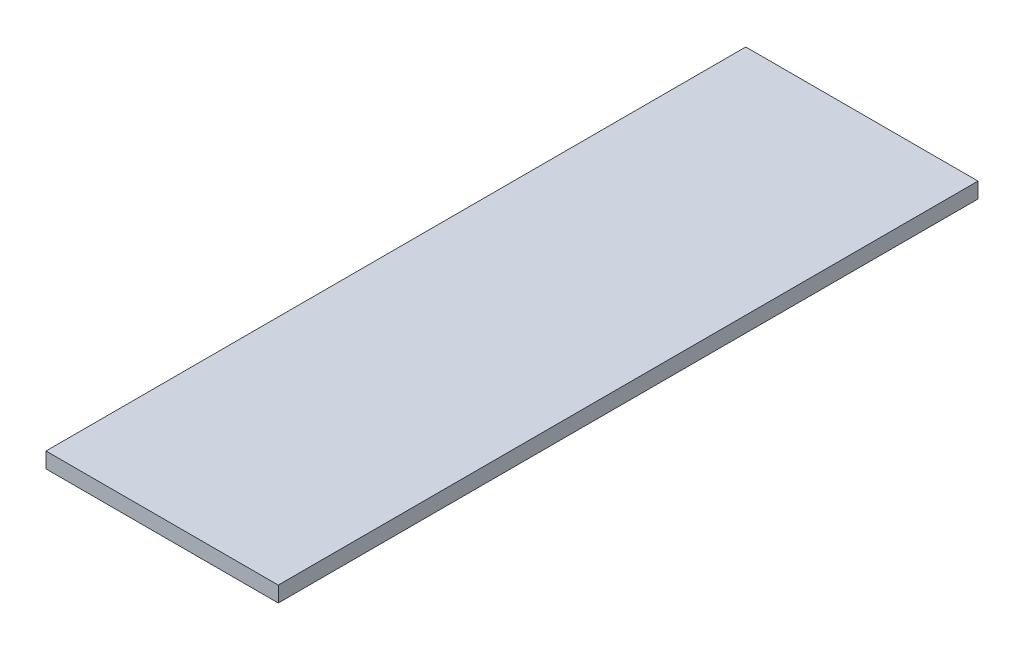
ISO-10303-21;
HEADER;
FILE_DESCRIPTION(('STEP AP214'),'2;1');
FILE_NAME('part.step','',(''),(''),'','','');
FILE_SCHEMA(('AUTOMOTIVE_DESIGN { 1 0 10303 214 1 1 1 1 }'));
ENDSEC;
DATA;
#1=APPLICATION_CONTEXT('core data for automotive mechanical design processes');
#2=APPLICATION_PROTOCOL_DEFINITION('international standard','automotive_design',2000,#1);
#3=PRODUCT_CONTEXT('',#1,'mechanical');
#4=PRODUCT('Part','Part','',(#3));
#5=PRODUCT_RELATED_PRODUCT_CATEGORY('part','',(#4));
#6=PRODUCT_DEFINITION_FORMATION('','',#4);
#7=PRODUCT_DEFINITION_CONTEXT('part definition',#1,'design');
#8=PRODUCT_DEFINITION('design','',#6,#7);
#9=PRODUCT_DEFINITION_SHAPE('','',#8);
#10=(LENGTH_UNIT() NAMED_UNIT(*) SI_UNIT(.MILLI.,.METRE.));
#11=(NAMED_UNIT(*) PLANE_ANGLE_UNIT() SI_UNIT($,.RADIAN.));
#12=(NAMED_UNIT(*) SI_UNIT($,.STERADIAN.) SOLID_ANGLE_UNIT());
#13=UNCERTAINTY_MEASURE_WITH_UNIT(LENGTH_MEASURE(1.E-05),#10,'distance_accuracy_value','');
#14=(GEOMETRIC_REPRESENTATION_CONTEXT(3) GLOBAL_UNCERTAINTY_ASSIGNED_CONTEXT((#13)) GLOBAL_UNIT_ASSIGNED_CONTEXT((#10,
#11,#12)) REPRESENTATION_CONTEXT('',''));
#15=CARTESIAN_POINT('',(0.,0.,0.));
#16=DIRECTION('',(0.,0.,1.));
#17=DIRECTION('',(1.,0.,0.));
#18=AXIS2_PLACEMENT_3D('',#15,#16,#17);
#19=CARTESIAN_POINT('',(182.5,5.,450.));
#20=DIRECTION('',(0.,-1.,0.));
#21=DIRECTION('',(1.,0.,0.));
#22=AXIS2_PLACEMENT_3D('',#19,#20,#21);
#23=PLANE('',#22);
#24=DIRECTION('',(-1.,0.,0.));
#25=VECTOR('',#24,1.);
#26=CARTESIAN_POINT('',(182.5,5.,0.));
#27=LINE('',#26,#25);
#28=CARTESIAN_POINT('',(331.858259493534,5.00000000000005,0.));
#29=VERTEX_POINT('',#28);
#30=CARTESIAN_POINT('',(182.5,5.,0.));
#31=VERTEX_POINT('',#30);
#32=EDGE_CURVE('E96',#29,#31,#27,.T.);
#33=ORIENTED_EDGE('',*,*,#32,.T.);
#34=DIRECTION('',(0.,0.,-1.));
#35=VECTOR('',#34,1.);
#36=CARTESIAN_POINT('',(182.5,5.,450.));
#37=LINE('',#36,#35);
#38=CARTESIAN_POINT('',(182.5,5.,450.));
#39=VERTEX_POINT('',#38);
#40=EDGE_CURVE('E11',#39,#31,#37,.T.);
#41=ORIENTED_EDGE('',*,*,#40,.F.);
#42=DIRECTION('',(-1.,0.,0.));
#43=VECTOR('',#42,1.);
#44=CARTESIAN_POINT('',(182.5,5.,450.));
#45=LINE('',#44,#43);
#46=CARTESIAN_POINT('',(331.858259493534,5.00000000000005,450.));
#47=VERTEX_POINT('',#46);
#48=EDGE_CURVE('E84',#47,#39,#45,.T.);
#49=ORIENTED_EDGE('',*,*,#48,.F.);
#50=DIRECTION('',(0.,0.,-1.));
#51=VECTOR('',#50,1.);
#52=CARTESIAN_POINT('',(331.858259493534,5.00000000000005,450.));
#53=LINE('',#52,#51);
#54=EDGE_CURVE('E92',#47,#29,#53,.T.);
#55=ORIENTED_EDGE('',*,*,#54,.T.);
#56=EDGE_LOOP('',(#33,#41,#49,#55));
#57=FACE_BOUND('',#56,.T.);
#58=ADVANCED_FACE('F33',(#57),#23,.F.);
#59=CARTESIAN_POINT('',(182.5,5.,450.));
#60=DIRECTION('',(1.,0.,0.));
#61=DIRECTION('',(0.,0.,-1.));
#62=AXIS2_PLACEMENT_3D('',#59,#60,#61);
#63=PLANE('',#62);
#64=DIRECTION('',(0.,-1.,0.));
#65=VECTOR('',#64,1.);
#66=CARTESIAN_POINT('',(182.5,5.,0.));
#67=LINE('',#66,#65);
#68=CARTESIAN_POINT('',(182.5,-5.,0.));
#69=VERTEX_POINT('',#68);
#70=EDGE_CURVE('E88',#31,#69,#67,.T.);
#71=ORIENTED_EDGE('',*,*,#70,.T.);
#72=DIRECTION('',(0.,0.,-1.));
#73=VECTOR('',#72,1.);
#74=CARTESIAN_POINT('',(182.5,-5.,450.));
#75=LINE('',#74,#73);
#76=CARTESIAN_POINT('',(182.5,-5.,450.));
#77=VERTEX_POINT('',#76);
#78=EDGE_CURVE('E41',#77,#69,#75,.T.);
#79=ORIENTED_EDGE('',*,*,#78,.F.);
#80=DIRECTION('',(0.,-1.,0.));
#81=VECTOR('',#80,1.);
#82=CARTESIAN_POINT('',(182.5,5.,450.));
#83=LINE('',#82,#81);
#84=EDGE_CURVE('E79',#39,#77,#83,.T.);
#85=ORIENTED_EDGE('',*,*,#84,.F.);
#86=ORIENTED_EDGE('',*,*,#40,.T.);
#87=EDGE_LOOP('',(#71,#79,#85,#86));
#88=FACE_BOUND('',#87,.T.);
#89=ADVANCED_FACE('F87',(#88),#63,.F.);
#90=CARTESIAN_POINT('',(182.5,-5.,450.));
#91=DIRECTION('',(0.,1.,0.));
#92=DIRECTION('',(-1.,0.,0.));
#93=AXIS2_PLACEMENT_3D('',#90,#91,#92);
#94=PLANE('',#93);
#95=DIRECTION('',(1.,0.,0.));
#96=VECTOR('',#95,1.);
#97=CARTESIAN_POINT('',(182.5,-5.,0.));
#98=LINE('',#97,#96);
#99=CARTESIAN_POINT('',(331.858259493534,-5.,0.));
#100=VERTEX_POINT('',#99);
#101=EDGE_CURVE('E66',#69,#100,#98,.T.);
#102=ORIENTED_EDGE('',*,*,#101,.T.);
#103=DIRECTION('',(0.,0.,-1.));
#104=VECTOR('',#103,1.);
#105=CARTESIAN_POINT('',(331.858259493534,-5.,450.));
#106=LINE('',#105,#104);
#107=CARTESIAN_POINT('',(331.858259493534,-5.,450.));
#108=VERTEX_POINT('',#107);
#109=EDGE_CURVE('E89',#108,#100,#106,.T.);
#110=ORIENTED_EDGE('',*,*,#109,.F.);
#111=DIRECTION('',(1.,0.,0.));
#112=VECTOR('',#111,1.);
#113=CARTESIAN_POINT('',(182.5,-5.,450.));
#114=LINE('',#113,#112);
#115=EDGE_CURVE('E82',#77,#108,#114,.T.);
#116=ORIENTED_EDGE('',*,*,#115,.F.);
#117=ORIENTED_EDGE('',*,*,#78,.T.);
#118=EDGE_LOOP('',(#102,#110,#116,#117));
#119=FACE_BOUND('',#118,.T.);
#120=ADVANCED_FACE('F90',(#119),#94,.F.);
#121=CARTESIAN_POINT('',(331.858259493534,5.00000000000005,450.));
#122=DIRECTION('',(-1.,0.,0.));
#123=DIRECTION('',(0.,0.,1.));
#124=AXIS2_PLACEMENT_3D('',#121,#122,#123);
#125=PLANE('',#124);
#126=DIRECTION('',(0.,1.,0.));
#127=VECTOR('',#126,1.);
#128=CARTESIAN_POINT('',(331.858259493534,5.00000000000005,0.));
#129=LINE('',#128,#127);
#130=EDGE_CURVE('E72',#100,#29,#129,.T.);
#131=ORIENTED_EDGE('',*,*,#130,.T.);
#132=ORIENTED_EDGE('',*,*,#54,.F.);
#133=DIRECTION('',(0.,1.,0.));
#134=VECTOR('',#133,1.);
#135=CARTESIAN_POINT('',(331.858259493534,5.00000000000005,450.));
#136=LINE('',#135,#134);
#137=EDGE_CURVE('E49',#108,#47,#136,.T.);
#138=ORIENTED_EDGE('',*,*,#137,.F.);
#139=ORIENTED_EDGE('',*,*,#109,.T.);
#140=EDGE_LOOP('',(#131,#132,#138,#139));
#141=FACE_BOUND('',#140,.T.);
#142=ADVANCED_FACE('F103',(#141),#125,.F.);
#143=CARTESIAN_POINT('',(0.,0.,450.));
#144=DIRECTION('',(0.,0.,-1.));
#145=DIRECTION('',(-1.,0.,0.));
#146=AXIS2_PLACEMENT_3D('',#143,#144,#145);
#147=PLANE('',#146);
#148=ORIENTED_EDGE('',*,*,#48,.T.);
#149=ORIENTED_EDGE('',*,*,#84,.T.);
#150=ORIENTED_EDGE('',*,*,#115,.T.);
#151=ORIENTED_EDGE('',*,*,#137,.T.);
#152=EDGE_LOOP('',(#148,#149,#150,#151));
#153=FACE_BOUND('',#152,.T.);
#154=ADVANCED_FACE('F80',(#153),#147,.F.);
#155=CARTESIAN_POINT('',(0.,0.,0.));
#156=DIRECTION('',(0.,0.,-1.));
#157=DIRECTION('',(-1.,0.,0.));
#158=AXIS2_PLACEMENT_3D('',#155,#156,#157);
#159=PLANE('',#158);
#160=ORIENTED_EDGE('',*,*,#32,.F.);
#161=ORIENTED_EDGE('',*,*,#130,.F.);
#162=ORIENTED_EDGE('',*,*,#101,.F.);
#163=ORIENTED_EDGE('',*,*,#70,.F.);
#164=EDGE_LOOP('',(#160,#161,#162,#163));
#165=FACE_BOUND('',#164,.T.);
#166=ADVANCED_FACE('F106',(#165),#159,.T.);
#167=CLOSED_SHELL('',(#58,#89,#120,#142,#154,#166));
#168=MANIFOLD_SOLID_BREP('B2',#167);
#169=ADVANCED_BREP_SHAPE_REPRESENTATION('',(#18,#168),#14);
#170=SHAPE_DEFINITION_REPRESENTATION(#9,#169);
ENDSEC;
END-ISO-10303-21;
